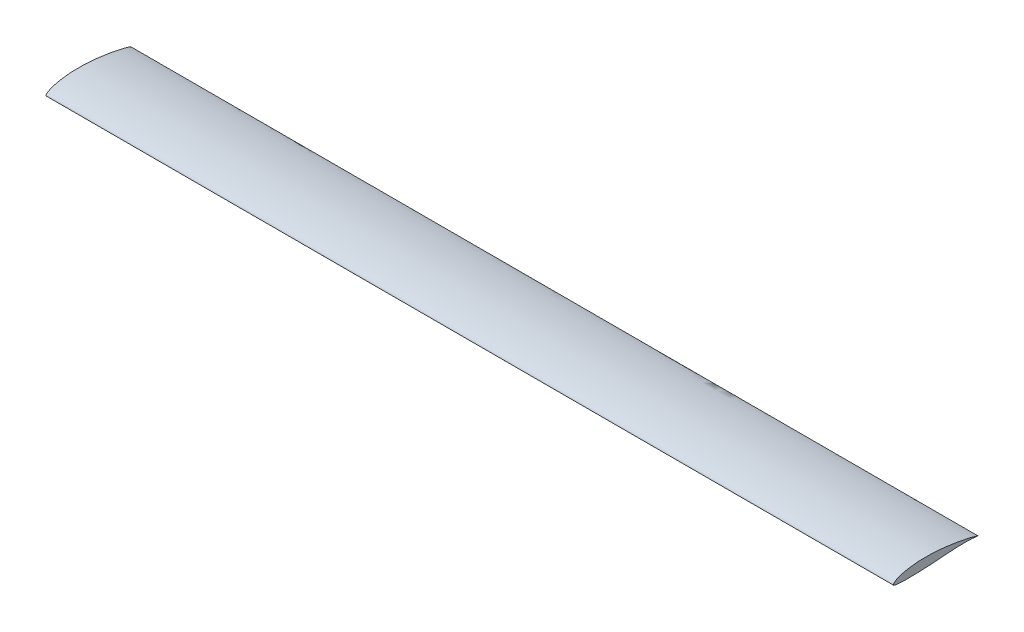
ISO-10303-21;
HEADER;
FILE_DESCRIPTION(('STEP AP214'),'2;1');
FILE_NAME('part.step','',(''),(''),'','','');
FILE_SCHEMA(('AUTOMOTIVE_DESIGN { 1 0 10303 214 1 1 1 1 }'));
ENDSEC;
DATA;
#1=APPLICATION_CONTEXT('core data for automotive mechanical design processes');
#2=APPLICATION_PROTOCOL_DEFINITION('international standard','automotive_design',2000,#1);
#3=PRODUCT_CONTEXT('',#1,'mechanical');
#4=PRODUCT('Part','Part','',(#3));
#5=PRODUCT_RELATED_PRODUCT_CATEGORY('part','',(#4));
#6=PRODUCT_DEFINITION_FORMATION('','',#4);
#7=PRODUCT_DEFINITION_CONTEXT('part definition',#1,'design');
#8=PRODUCT_DEFINITION('design','',#6,#7);
#9=PRODUCT_DEFINITION_SHAPE('','',#8);
#10=(LENGTH_UNIT() NAMED_UNIT(*) SI_UNIT(.MILLI.,.METRE.));
#11=(NAMED_UNIT(*) PLANE_ANGLE_UNIT() SI_UNIT($,.RADIAN.));
#12=(NAMED_UNIT(*) SI_UNIT($,.STERADIAN.) SOLID_ANGLE_UNIT());
#13=UNCERTAINTY_MEASURE_WITH_UNIT(LENGTH_MEASURE(1.E-05),#10,'distance_accuracy_value','');
#14=(GEOMETRIC_REPRESENTATION_CONTEXT(3) GLOBAL_UNCERTAINTY_ASSIGNED_CONTEXT((#13)) GLOBAL_UNIT_ASSIGNED_CONTEXT((#10,
#11,#12)) REPRESENTATION_CONTEXT('',''));
#15=CARTESIAN_POINT('',(0.,0.,0.));
#16=DIRECTION('',(0.,0.,1.));
#17=DIRECTION('',(1.,0.,0.));
#18=AXIS2_PLACEMENT_3D('',#15,#16,#17);
#19=CARTESIAN_POINT('',(100.,0.,-10.));
#20=CARTESIAN_POINT('',(100.,0.000713131672660654,-9.99993941925503));
#21=CARTESIAN_POINT('',(100.,0.0202964017588496,-9.93165713267436));
#22=CARTESIAN_POINT('',(100.,0.0458066157011733,-9.86584565164607));
#23=CARTESIAN_POINT('',(100.,0.0984613442761603,-9.71337073207764));
#24=CARTESIAN_POINT('',(100.,0.155440178397983,-9.52993449602626));
#25=CARTESIAN_POINT('',(100.,0.21860364857658,-9.293258869105));
#26=CARTESIAN_POINT('',(100.,0.287099470877693,-9.01508352047661));
#27=CARTESIAN_POINT('',(100.,0.361022069907473,-8.69582749165231));
#28=CARTESIAN_POINT('',(100.,0.437693329852619,-8.34094208187145));
#29=CARTESIAN_POINT('',(100.,0.513471694982274,-7.95373543579804));
#30=CARTESIAN_POINT('',(100.,0.586629561757957,-7.53804155109912));
#31=CARTESIAN_POINT('',(100.,0.656388807733919,-7.09806897082408));
#32=CARTESIAN_POINT('',(100.,0.722531418949126,-6.63890705569256));
#33=CARTESIAN_POINT('',(100.,0.782926954133895,-6.16595855713501));
#34=CARTESIAN_POINT('',(100.,0.836187713608955,-5.68467508783323));
#35=CARTESIAN_POINT('',(100.,0.879415237032795,-5.1999379149616));
#36=CARTESIAN_POINT('',(100.,0.911307468422591,-4.71629954037847));
#37=CARTESIAN_POINT('',(100.,0.93024643707952,-4.23793760499129));
#38=CARTESIAN_POINT('',(100.,0.935594448570144,-3.76887194740534));
#39=CARTESIAN_POINT('',(100.,0.92676753498626,-3.31290055805451));
#40=CARTESIAN_POINT('',(100.,0.903714805437799,-2.87361407329344));
#41=CARTESIAN_POINT('',(100.,0.867219960311107,-2.4544629813055));
#42=CARTESIAN_POINT('',(100.,0.817843427340506,-2.05892988844835));
#43=CARTESIAN_POINT('',(100.,0.757404767296879,-1.69026745354065));
#44=CARTESIAN_POINT('',(100.,0.687055297962203,-1.35171613843919));
#45=CARTESIAN_POINT('',(100.,0.60834613048534,-1.04625783453279));
#46=CARTESIAN_POINT('',(100.,0.523373057296846,-0.776384475263586));
#47=CARTESIAN_POINT('',(100.,0.433317227594609,-0.544671565809398));
#48=CARTESIAN_POINT('',(100.,0.340782127334291,-0.352222267426542));
#49=CARTESIAN_POINT('',(100.,0.24801308819013,-0.201446651821352));
#50=CARTESIAN_POINT('',(100.,0.157191328169546,-0.0900215025076335));
#51=CARTESIAN_POINT('',(100.,0.0756511560711327,-0.0246274865136038));
#52=CARTESIAN_POINT('',(100.,-0.00741808176702041,0.0132105074577552));
#53=CARTESIAN_POINT('',(100.,-0.0803213304441086,-0.0434259401368055));
#54=CARTESIAN_POINT('',(100.,-0.114655334658784,-0.14801910559194));
#55=CARTESIAN_POINT('',(100.,-0.154423122400591,-0.298411847705835));
#56=CARTESIAN_POINT('',(100.,-0.182096969514673,-0.501978630192672));
#57=CARTESIAN_POINT('',(100.,-0.204011203592054,-0.754724850704881));
#58=CARTESIAN_POINT('',(100.,-0.218063094237329,-1.05553357402019));
#59=CARTESIAN_POINT('',(100.,-0.224872077994962,-1.40125826919379));
#60=CARTESIAN_POINT('',(100.,-0.225405077095041,-1.78835172580853));
#61=CARTESIAN_POINT('',(100.,-0.219892261659939,-2.21254413950867));
#62=CARTESIAN_POINT('',(100.,-0.209065919634969,-2.6688946616973));
#63=CARTESIAN_POINT('',(100.,-0.193182013785784,-3.15194108916705));
#64=CARTESIAN_POINT('',(100.,-0.172704407051196,-3.65581937010124));
#65=CARTESIAN_POINT('',(100.,-0.146536268128544,-4.17530511744067));
#66=CARTESIAN_POINT('',(100.,-0.110887508973558,-4.70670188543709));
#67=CARTESIAN_POINT('',(100.,-0.0676307974710104,-5.24708271732748));
#68=CARTESIAN_POINT('',(100.,-0.0239773378972573,-5.79260840067285));
#69=CARTESIAN_POINT('',(100.,0.0161623600198908,-6.33654991696913));
#70=CARTESIAN_POINT('',(100.,0.0502631401492865,-6.87077292134727));
#71=CARTESIAN_POINT('',(100.,0.0766347552713929,-7.3868830003348));
#72=CARTESIAN_POINT('',(100.,0.093417534551672,-7.87667774988582));
#73=CARTESIAN_POINT('',(100.,0.100905323665762,-8.3317719131661));
#74=CARTESIAN_POINT('',(100.,0.0987236436059639,-8.74489495979886));
#75=CARTESIAN_POINT('',(100.,0.0887266352026026,-9.10716529271704));
#76=CARTESIAN_POINT('',(100.,0.0709162025356917,-9.4164201381981));
#77=CARTESIAN_POINT('',(100.,0.0511279518719556,-9.65361018146708));
#78=CARTESIAN_POINT('',(100.,0.0248510396465296,-9.84567095785427));
#79=CARTESIAN_POINT('',(100.,0.0151683546978983,-9.92411822751088));
#80=CARTESIAN_POINT('',(100.,-0.000739778303842171,-10.0000628443841));
#81=CARTESIAN_POINT('',(100.,0.,-10.));
#82=B_SPLINE_CURVE_WITH_KNOTS('',3,(#19,#20,#21,#22,#23,#24,#25,#26,#27,#28,#29,#30,#31,#32,#33,
#34,#35,#36,#37,#38,#39,#40,#41,#42,#43,#44,#45,#46,#47,#48,#49,#50,#51,#52,#53,#54,#55,#56,#57,
#58,#59,#60,#61,#62,#63,#64,#65,#66,#67,#68,#69,#70,#71,#72,#73,#74,#75,#76,#77,#78,#79,#80,
#81),.UNSPECIFIED.,.T.,.F.,(4,1,1,1,1,1,1,1,1,1,1,1,1,1,1,1,1,1,1,1,1,1,1,1,1,1,1,1,1,1,1,1,1,1,
1,1,1,1,1,1,1,1,1,1,1,1,1,1,1,1,1,1,1,1,1,1,1,1,1,1,4),(0.,0.00170160583386817,
0.00653126690194174,0.0139280953899581,0.0235891530137695,0.0355317246769186,0.0496891320688308,
0.0658341934623292,0.0837147514459256,0.103116064691838,0.123878751756274,0.14581420915297,
0.168656186282393,0.192131249278035,0.215962296114593,0.239896617442778,0.263728890073772,
0.287268528737387,0.310325540169975,0.332738256112828,0.354357712180516,0.375035600981313,
0.394628910591468,0.412991171173065,0.429987473382267,0.445487222559682,0.459384641946074,
0.471588612153603,0.482044560288396,0.490731557106011,0.49766307626149,0.502883530532003,
0.506484353193678,0.509678407794817,0.514915305706027,0.522533047876316,0.532593992254689,
0.545061776174428,0.559871774365292,0.576884262373741,0.595937965597378,0.616822521663444,
0.639300677455514,0.663099708678466,0.687931905088611,0.713498098562696,0.739627385881498,
0.7662897649477,0.793259504878586,0.820148504532894,0.846537948712817,0.872019130062849,
0.896182354341241,0.918637466052276,0.938996032796404,0.956919688792439,0.972084765558715,
0.984184443308545,0.992950328766134,0.99823481255184,1.),.UNSPECIFIED.);
#83=DIRECTION('',(-1.,0.,0.));
#84=VECTOR('',#83,1.);
#85=SURFACE_OF_LINEAR_EXTRUSION('',#82,#84);
#86=CARTESIAN_POINT('',(100.,0.,-10.));
#87=VERTEX_POINT('',#86);
#88=EDGE_CURVE('E10',#87,#87,#82,.T.);
#89=ORIENTED_EDGE('',*,*,#88,.F.);
#90=EDGE_LOOP('',(#89));
#91=FACE_BOUND('',#90,.T.);
#92=CARTESIAN_POINT('',(0.,0.,-10.));
#93=CARTESIAN_POINT('',(0.,0.000713131672660654,-9.99993941925503));
#94=CARTESIAN_POINT('',(0.,0.0202964017588496,-9.93165713267436));
#95=CARTESIAN_POINT('',(0.,0.0458066157011733,-9.86584565164607));
#96=CARTESIAN_POINT('',(0.,0.0984613442761603,-9.71337073207764));
#97=CARTESIAN_POINT('',(0.,0.155440178397983,-9.52993449602626));
#98=CARTESIAN_POINT('',(0.,0.21860364857658,-9.293258869105));
#99=CARTESIAN_POINT('',(0.,0.287099470877693,-9.01508352047661));
#100=CARTESIAN_POINT('',(0.,0.361022069907473,-8.69582749165231));
#101=CARTESIAN_POINT('',(0.,0.437693329852619,-8.34094208187145));
#102=CARTESIAN_POINT('',(0.,0.513471694982274,-7.95373543579804));
#103=CARTESIAN_POINT('',(0.,0.586629561757957,-7.53804155109912));
#104=CARTESIAN_POINT('',(0.,0.656388807733919,-7.09806897082408));
#105=CARTESIAN_POINT('',(0.,0.722531418949126,-6.63890705569256));
#106=CARTESIAN_POINT('',(0.,0.782926954133895,-6.16595855713501));
#107=CARTESIAN_POINT('',(0.,0.836187713608955,-5.68467508783323));
#108=CARTESIAN_POINT('',(0.,0.879415237032795,-5.1999379149616));
#109=CARTESIAN_POINT('',(0.,0.911307468422591,-4.71629954037847));
#110=CARTESIAN_POINT('',(0.,0.93024643707952,-4.23793760499129));
#111=CARTESIAN_POINT('',(0.,0.935594448570144,-3.76887194740534));
#112=CARTESIAN_POINT('',(0.,0.92676753498626,-3.31290055805451));
#113=CARTESIAN_POINT('',(0.,0.903714805437799,-2.87361407329344));
#114=CARTESIAN_POINT('',(0.,0.867219960311107,-2.4544629813055));
#115=CARTESIAN_POINT('',(0.,0.817843427340506,-2.05892988844835));
#116=CARTESIAN_POINT('',(0.,0.757404767296879,-1.69026745354065));
#117=CARTESIAN_POINT('',(0.,0.687055297962203,-1.35171613843919));
#118=CARTESIAN_POINT('',(0.,0.60834613048534,-1.04625783453279));
#119=CARTESIAN_POINT('',(0.,0.523373057296846,-0.776384475263586));
#120=CARTESIAN_POINT('',(0.,0.433317227594609,-0.544671565809398));
#121=CARTESIAN_POINT('',(0.,0.340782127334291,-0.352222267426542));
#122=CARTESIAN_POINT('',(0.,0.24801308819013,-0.201446651821352));
#123=CARTESIAN_POINT('',(0.,0.157191328169546,-0.0900215025076335));
#124=CARTESIAN_POINT('',(0.,0.0756511560711327,-0.0246274865136038));
#125=CARTESIAN_POINT('',(0.,-0.00741808176702041,0.0132105074577552));
#126=CARTESIAN_POINT('',(0.,-0.0803213304441086,-0.0434259401368055));
#127=CARTESIAN_POINT('',(0.,-0.114655334658784,-0.14801910559194));
#128=CARTESIAN_POINT('',(0.,-0.154423122400591,-0.298411847705835));
#129=CARTESIAN_POINT('',(0.,-0.182096969514673,-0.501978630192672));
#130=CARTESIAN_POINT('',(0.,-0.204011203592054,-0.754724850704881));
#131=CARTESIAN_POINT('',(0.,-0.218063094237329,-1.05553357402019));
#132=CARTESIAN_POINT('',(0.,-0.224872077994962,-1.40125826919379));
#133=CARTESIAN_POINT('',(0.,-0.225405077095041,-1.78835172580853));
#134=CARTESIAN_POINT('',(0.,-0.219892261659939,-2.21254413950867));
#135=CARTESIAN_POINT('',(0.,-0.209065919634969,-2.6688946616973));
#136=CARTESIAN_POINT('',(0.,-0.193182013785784,-3.15194108916705));
#137=CARTESIAN_POINT('',(0.,-0.172704407051196,-3.65581937010124));
#138=CARTESIAN_POINT('',(0.,-0.146536268128544,-4.17530511744067));
#139=CARTESIAN_POINT('',(0.,-0.110887508973558,-4.70670188543709));
#140=CARTESIAN_POINT('',(0.,-0.0676307974710104,-5.24708271732748));
#141=CARTESIAN_POINT('',(0.,-0.0239773378972573,-5.79260840067285));
#142=CARTESIAN_POINT('',(0.,0.0161623600198908,-6.33654991696913));
#143=CARTESIAN_POINT('',(0.,0.0502631401492865,-6.87077292134727));
#144=CARTESIAN_POINT('',(0.,0.0766347552713929,-7.3868830003348));
#145=CARTESIAN_POINT('',(0.,0.093417534551672,-7.87667774988582));
#146=CARTESIAN_POINT('',(0.,0.100905323665762,-8.3317719131661));
#147=CARTESIAN_POINT('',(0.,0.0987236436059639,-8.74489495979886));
#148=CARTESIAN_POINT('',(0.,0.0887266352026026,-9.10716529271704));
#149=CARTESIAN_POINT('',(0.,0.0709162025356917,-9.4164201381981));
#150=CARTESIAN_POINT('',(0.,0.0511279518719556,-9.65361018146708));
#151=CARTESIAN_POINT('',(0.,0.0248510396465296,-9.84567095785427));
#152=CARTESIAN_POINT('',(0.,0.0151683546978983,-9.92411822751088));
#153=CARTESIAN_POINT('',(0.,-0.000739778303842171,-10.0000628443841));
#154=CARTESIAN_POINT('',(0.,0.,-10.));
#155=B_SPLINE_CURVE_WITH_KNOTS('',3,(#92,#93,#94,#95,#96,#97,#98,#99,#100,#101,#102,#103,#104,
#105,#106,#107,#108,#109,#110,#111,#112,#113,#114,#115,#116,#117,#118,#119,#120,#121,#122,#123,
#124,#125,#126,#127,#128,#129,#130,#131,#132,#133,#134,#135,#136,#137,#138,#139,#140,#141,#142,
#143,#144,#145,#146,#147,#148,#149,#150,#151,#152,#153,#154),.UNSPECIFIED.,.T.,.F.,(4,1,1,1,1,1,
1,1,1,1,1,1,1,1,1,1,1,1,1,1,1,1,1,1,1,1,1,1,1,1,1,1,1,1,1,1,1,1,1,1,1,1,1,1,1,1,1,1,1,1,1,1,1,1,
1,1,1,1,1,1,4),(0.,0.00170160583386817,0.00653126690194174,0.0139280953899581,
0.0235891530137695,0.0355317246769186,0.0496891320688308,0.0658341934623292,0.0837147514459256,
0.103116064691838,0.123878751756274,0.14581420915297,0.168656186282393,0.192131249278035,
0.215962296114593,0.239896617442778,0.263728890073772,0.287268528737387,0.310325540169975,
0.332738256112828,0.354357712180516,0.375035600981313,0.394628910591468,0.412991171173065,
0.429987473382267,0.445487222559682,0.459384641946074,0.471588612153603,0.482044560288396,
0.490731557106011,0.49766307626149,0.502883530532003,0.506484353193678,0.509678407794817,
0.514915305706027,0.522533047876316,0.532593992254689,0.545061776174428,0.559871774365292,
0.576884262373741,0.595937965597378,0.616822521663444,0.639300677455514,0.663099708678466,
0.687931905088611,0.713498098562696,0.739627385881498,0.7662897649477,0.793259504878586,
0.820148504532894,0.846537948712817,0.872019130062849,0.896182354341241,0.918637466052276,
0.938996032796404,0.956919688792439,0.972084765558715,0.984184443308545,0.992950328766134,
0.99823481255184,1.),.UNSPECIFIED.);
#156=CARTESIAN_POINT('',(0.,0.,-10.));
#157=VERTEX_POINT('',#156);
#158=EDGE_CURVE('E34',#157,#157,#155,.T.);
#159=ORIENTED_EDGE('',*,*,#158,.T.);
#160=EDGE_LOOP('',(#159));
#161=FACE_BOUND('',#160,.T.);
#162=ADVANCED_FACE('F30',(#91,#161),#85,.F.);
#163=CARTESIAN_POINT('',(100.,0.111254427407412,-0.0545444794022664));
#164=DIRECTION('',(-1.,0.,0.));
#165=DIRECTION('',(0.,0.,1.));
#166=AXIS2_PLACEMENT_3D('',#163,#164,#165);
#167=PLANE('',#166);
#168=ORIENTED_EDGE('',*,*,#88,.T.);
#169=EDGE_LOOP('',(#168));
#170=FACE_BOUND('',#169,.T.);
#171=ADVANCED_FACE('F53',(#170),#167,.F.);
#172=CARTESIAN_POINT('',(0.,0.111254427407412,-0.0545444794022664));
#173=DIRECTION('',(-1.,0.,0.));
#174=DIRECTION('',(0.,0.,1.));
#175=AXIS2_PLACEMENT_3D('',#172,#173,#174);
#176=PLANE('',#175);
#177=ORIENTED_EDGE('',*,*,#158,.F.);
#178=EDGE_LOOP('',(#177));
#179=FACE_BOUND('',#178,.T.);
#180=ADVANCED_FACE('F51',(#179),#176,.T.);
#181=CLOSED_SHELL('',(#162,#171,#180));
#182=MANIFOLD_SOLID_BREP('B2',#181);
#183=ADVANCED_BREP_SHAPE_REPRESENTATION('',(#18,#182),#14);
#184=SHAPE_DEFINITION_REPRESENTATION(#9,#183);
ENDSEC;
END-ISO-10303-21;
